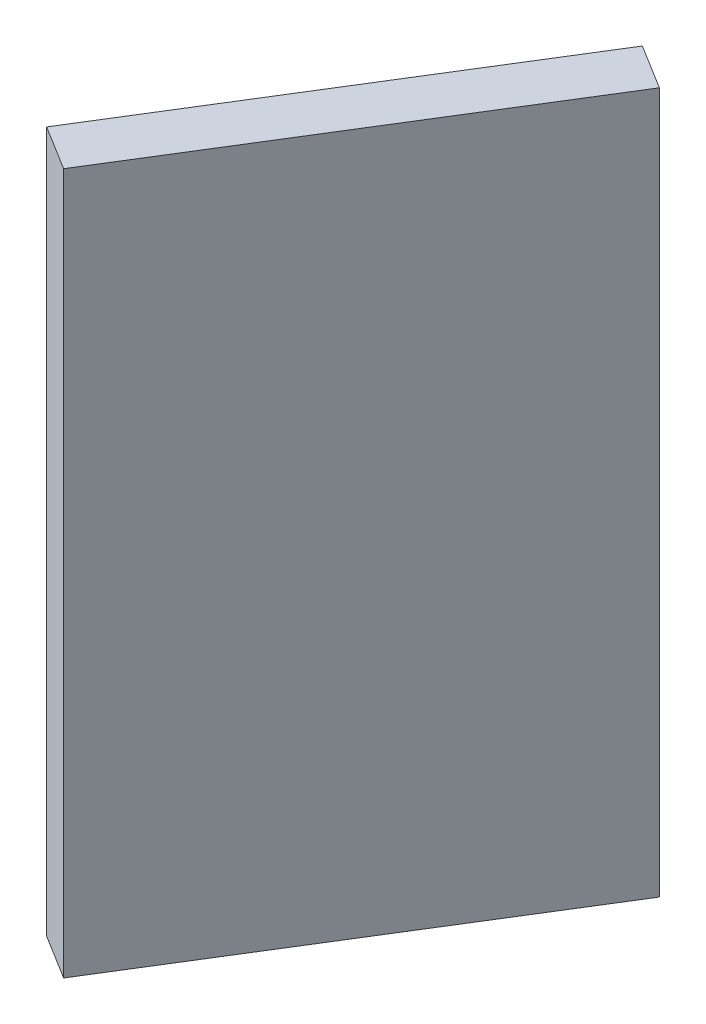
ISO-10303-21;
HEADER;
FILE_DESCRIPTION(('STEP AP214'),'2;1');
FILE_NAME('part.step','',(''),(''),'','','');
FILE_SCHEMA(('AUTOMOTIVE_DESIGN { 1 0 10303 214 1 1 1 1 }'));
ENDSEC;
DATA;
#1=APPLICATION_CONTEXT('core data for automotive mechanical design processes');
#2=APPLICATION_PROTOCOL_DEFINITION('international standard','automotive_design',2000,#1);
#3=PRODUCT_CONTEXT('',#1,'mechanical');
#4=PRODUCT('Part','Part','',(#3));
#5=PRODUCT_RELATED_PRODUCT_CATEGORY('part','',(#4));
#6=PRODUCT_DEFINITION_FORMATION('','',#4);
#7=PRODUCT_DEFINITION_CONTEXT('part definition',#1,'design');
#8=PRODUCT_DEFINITION('design','',#6,#7);
#9=PRODUCT_DEFINITION_SHAPE('','',#8);
#10=(LENGTH_UNIT() NAMED_UNIT(*) SI_UNIT(.MILLI.,.METRE.));
#11=(NAMED_UNIT(*) PLANE_ANGLE_UNIT() SI_UNIT($,.RADIAN.));
#12=(NAMED_UNIT(*) SI_UNIT($,.STERADIAN.) SOLID_ANGLE_UNIT());
#13=UNCERTAINTY_MEASURE_WITH_UNIT(LENGTH_MEASURE(1.E-05),#10,'distance_accuracy_value','');
#14=(GEOMETRIC_REPRESENTATION_CONTEXT(3) GLOBAL_UNCERTAINTY_ASSIGNED_CONTEXT((#13)) GLOBAL_UNIT_ASSIGNED_CONTEXT((#10,
#11,#12)) REPRESENTATION_CONTEXT('',''));
#15=CARTESIAN_POINT('',(0.,0.,0.));
#16=DIRECTION('',(0.,0.,1.));
#17=DIRECTION('',(1.,0.,0.));
#18=AXIS2_PLACEMENT_3D('',#15,#16,#17);
#19=CARTESIAN_POINT('',(50.0939752593712,-39.649,270.451139375088));
#20=DIRECTION('',(-0.526354614616244,0.,0.850265146687894));
#21=DIRECTION('',(-0.850265146687894,0.,-0.526354614616244));
#22=AXIS2_PLACEMENT_3D('',#19,#20,#21);
#23=PLANE('',#22);
#24=DIRECTION('',(-0.850265146687991,0.,-0.526354614616087));
#25=VECTOR('',#24,1.);
#26=CARTESIAN_POINT('',(50.0931249942245,-79.65,270.450613020473));
#27=LINE('',#26,#25);
#28=CARTESIAN_POINT('',(50.0931249942246,-79.65,270.450613020473));
#29=VERTEX_POINT('',#28);
#30=CARTESIAN_POINT('',(47.5423295541606,-79.65,268.871549176625));
#31=VERTEX_POINT('',#30);
#32=EDGE_CURVE('E73',#29,#31,#27,.T.);
#33=ORIENTED_EDGE('',*,*,#32,.F.);
#34=DIRECTION('',(0.,-1.,0.));
#35=VECTOR('',#34,1.);
#36=CARTESIAN_POINT('',(50.0931249942246,-59.65,270.450613020473));
#37=LINE('',#36,#35);
#38=CARTESIAN_POINT('',(50.0931249942246,-39.65,270.450613020473));
#39=VERTEX_POINT('',#38);
#40=EDGE_CURVE('E61',#39,#29,#37,.T.);
#41=ORIENTED_EDGE('',*,*,#40,.F.);
#42=DIRECTION('',(0.85026514668799,0.,0.526354614616088));
#43=VECTOR('',#42,1.);
#44=CARTESIAN_POINT('',(47.5423295541609,-39.65,268.871549176625));
#45=LINE('',#44,#43);
#46=CARTESIAN_POINT('',(47.5423295541606,-39.65,268.871549176625));
#47=VERTEX_POINT('',#46);
#48=EDGE_CURVE('E20',#47,#39,#45,.T.);
#49=ORIENTED_EDGE('',*,*,#48,.F.);
#50=DIRECTION('',(0.,1.,0.));
#51=VECTOR('',#50,1.);
#52=CARTESIAN_POINT('',(47.5423295541606,-59.65,268.871549176625));
#53=LINE('',#52,#51);
#54=EDGE_CURVE('E60',#31,#47,#53,.T.);
#55=ORIENTED_EDGE('',*,*,#54,.F.);
#56=EDGE_LOOP('',(#33,#41,#49,#55));
#57=FACE_BOUND('',#56,.T.);
#58=ADVANCED_FACE('F16',(#57),#23,.T.);
#59=CARTESIAN_POINT('',(63.0941249942245,-39.65,247.870549176625));
#60=DIRECTION('',(0.,1.,0.));
#61=DIRECTION('',(-1.,0.,0.));
#62=AXIS2_PLACEMENT_3D('',#59,#60,#61);
#63=PLANE('',#62);
#64=DIRECTION('',(0.526354614616306,0.,-0.850265146687855));
#65=VECTOR('',#64,1.);
#66=CARTESIAN_POINT('',(54.0423295541609,-39.65,258.371549176624));
#67=LINE('',#66,#65);
#68=CARTESIAN_POINT('',(60.5423295543735,-39.65,247.871549176757));
#69=VERTEX_POINT('',#68);
#70=EDGE_CURVE('E67',#47,#69,#67,.T.);
#71=ORIENTED_EDGE('',*,*,#70,.F.);
#72=ORIENTED_EDGE('',*,*,#48,.T.);
#73=DIRECTION('',(-0.526354614616301,0.,0.850265146687858));
#74=VECTOR('',#73,1.);
#75=CARTESIAN_POINT('',(56.5931249942245,-39.65,259.950613020473));
#76=LINE('',#75,#74);
#77=CARTESIAN_POINT('',(63.0931249940929,-39.65,249.450613020686));
#78=VERTEX_POINT('',#77);
#79=EDGE_CURVE('E65',#78,#39,#76,.T.);
#80=ORIENTED_EDGE('',*,*,#79,.F.);
#81=DIRECTION('',(0.850265146687867,0.,0.526354614616286));
#82=VECTOR('',#81,1.);
#83=CARTESIAN_POINT('',(61.8177272741927,-39.65,248.661081098549));
#84=LINE('',#83,#82);
#85=EDGE_CURVE('E70',#69,#78,#84,.T.);
#86=ORIENTED_EDGE('',*,*,#85,.F.);
#87=EDGE_LOOP('',(#71,#72,#80,#86));
#88=FACE_BOUND('',#87,.T.);
#89=ADVANCED_FACE('F68',(#88),#63,.T.);
#90=CARTESIAN_POINT('',(63.0936513488391,-39.649,249.449762755327));
#91=DIRECTION('',(0.850265146687858,0.,0.526354614616301));
#92=DIRECTION('',(-0.526354614616301,0.,0.850265146687858));
#93=AXIS2_PLACEMENT_3D('',#90,#91,#92);
#94=PLANE('',#93);
#95=DIRECTION('',(-0.526354614616296,0.,0.850265146687861));
#96=VECTOR('',#95,1.);
#97=CARTESIAN_POINT('',(63.0931249942245,-79.65,249.450613020473));
#98=LINE('',#97,#96);
#99=CARTESIAN_POINT('',(63.0931249942243,-79.65,249.450613020473));
#100=VERTEX_POINT('',#99);
#101=EDGE_CURVE('E88',#100,#29,#98,.T.);
#102=ORIENTED_EDGE('',*,*,#101,.F.);
#103=DIRECTION('',(0.,-1.,0.));
#104=VECTOR('',#103,1.);
#105=CARTESIAN_POINT('',(63.0931249942243,-59.65,249.450613020473));
#106=LINE('',#105,#104);
#107=EDGE_CURVE('E82',#78,#100,#106,.T.);
#108=ORIENTED_EDGE('',*,*,#107,.F.);
#109=ORIENTED_EDGE('',*,*,#79,.T.);
#110=ORIENTED_EDGE('',*,*,#40,.T.);
#111=EDGE_LOOP('',(#102,#108,#109,#110));
#112=FACE_BOUND('',#111,.T.);
#113=ADVANCED_FACE('F102',(#112),#94,.T.);
#114=CARTESIAN_POINT('',(47.5413295541609,-79.65,247.870549176625));
#115=DIRECTION('',(0.,-1.,0.));
#116=DIRECTION('',(1.,0.,0.));
#117=AXIS2_PLACEMENT_3D('',#114,#115,#116);
#118=PLANE('',#117);
#119=DIRECTION('',(-0.526354614616306,0.,0.850265146687855));
#120=VECTOR('',#119,1.);
#121=CARTESIAN_POINT('',(54.0423295541609,-79.65,258.371549176624));
#122=LINE('',#121,#120);
#123=CARTESIAN_POINT('',(60.5423295540293,-79.65,247.871549176837));
#124=VERTEX_POINT('',#123);
#125=EDGE_CURVE('E36',#124,#31,#122,.T.);
#126=ORIENTED_EDGE('',*,*,#125,.F.);
#127=DIRECTION('',(-0.850265146687867,0.,-0.526354614616286));
#128=VECTOR('',#127,1.);
#129=CARTESIAN_POINT('',(61.8177272741927,-79.65,248.661081098549));
#130=LINE('',#129,#128);
#131=EDGE_CURVE('E27',#100,#124,#130,.T.);
#132=ORIENTED_EDGE('',*,*,#131,.F.);
#133=ORIENTED_EDGE('',*,*,#101,.T.);
#134=ORIENTED_EDGE('',*,*,#32,.T.);
#135=EDGE_LOOP('',(#126,#132,#133,#134));
#136=FACE_BOUND('',#135,.T.);
#137=ADVANCED_FACE('F99',(#136),#118,.T.);
#138=CARTESIAN_POINT('',(47.5418031995463,-39.649,268.872399441771));
#139=DIRECTION('',(-0.850265146687855,0.,-0.526354614616306));
#140=DIRECTION('',(0.526354614616306,0.,-0.850265146687855));
#141=AXIS2_PLACEMENT_3D('',#138,#139,#140);
#142=PLANE('',#141);
#143=ORIENTED_EDGE('',*,*,#125,.T.);
#144=ORIENTED_EDGE('',*,*,#54,.T.);
#145=ORIENTED_EDGE('',*,*,#70,.T.);
#146=DIRECTION('',(0.,1.,0.));
#147=VECTOR('',#146,1.);
#148=CARTESIAN_POINT('',(60.5423295541611,-59.65,247.871549176625));
#149=LINE('',#148,#147);
#150=EDGE_CURVE('E11',#124,#69,#149,.T.);
#151=ORIENTED_EDGE('',*,*,#150,.F.);
#152=EDGE_LOOP('',(#143,#144,#145,#151));
#153=FACE_BOUND('',#152,.T.);
#154=ADVANCED_FACE('F75',(#153),#142,.T.);
#155=CARTESIAN_POINT('',(60.5414792890143,-39.649,247.87102282201));
#156=DIRECTION('',(0.526354614616286,0.,-0.850265146687867));
#157=DIRECTION('',(0.850265146687867,0.,0.526354614616286));
#158=AXIS2_PLACEMENT_3D('',#155,#156,#157);
#159=PLANE('',#158);
#160=ORIENTED_EDGE('',*,*,#131,.T.);
#161=ORIENTED_EDGE('',*,*,#150,.T.);
#162=ORIENTED_EDGE('',*,*,#85,.T.);
#163=ORIENTED_EDGE('',*,*,#107,.T.);
#164=EDGE_LOOP('',(#160,#161,#162,#163));
#165=FACE_BOUND('',#164,.T.);
#166=ADVANCED_FACE('F18',(#165),#159,.T.);
#167=CLOSED_SHELL('',(#58,#89,#113,#137,#154,#166));
#168=MANIFOLD_SOLID_BREP('B1',#167);
#169=ADVANCED_BREP_SHAPE_REPRESENTATION('',(#18,#168),#14);
#170=SHAPE_DEFINITION_REPRESENTATION(#9,#169);
ENDSEC;
END-ISO-10303-21;
